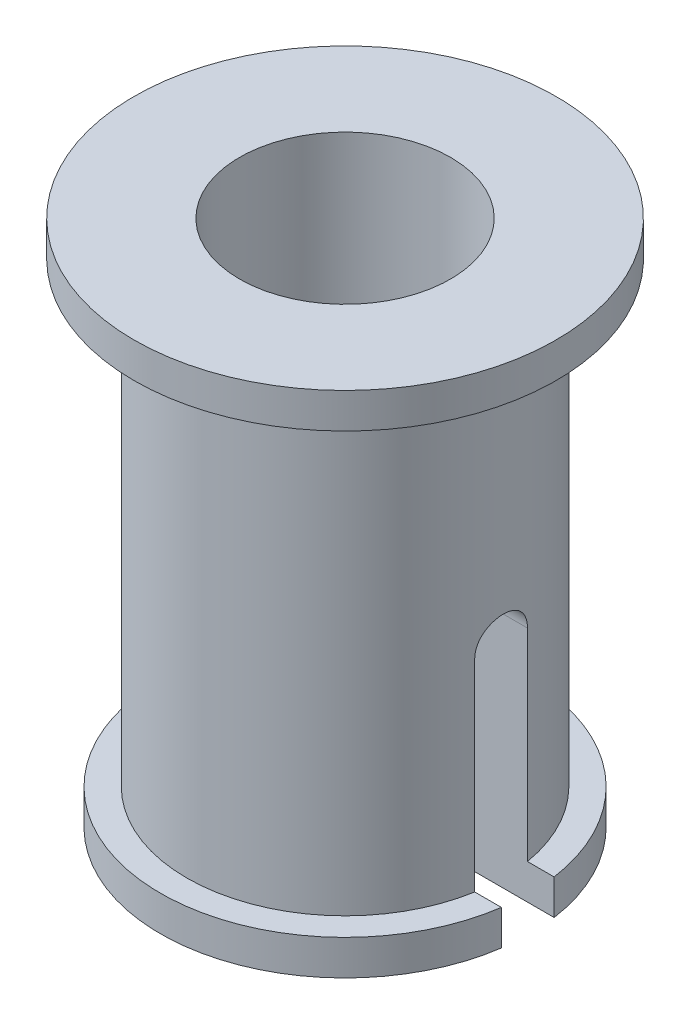
ISO-10303-21;
HEADER;
FILE_DESCRIPTION(('STEP AP214'),'2;1');
FILE_NAME('part.step','',(''),(''),'','','');
FILE_SCHEMA(('AUTOMOTIVE_DESIGN { 1 0 10303 214 1 1 1 1 }'));
ENDSEC;
DATA;
#1=APPLICATION_CONTEXT('core data for automotive mechanical design processes');
#2=APPLICATION_PROTOCOL_DEFINITION('international standard','automotive_design',2000,#1);
#3=PRODUCT_CONTEXT('',#1,'mechanical');
#4=PRODUCT('Part','Part','',(#3));
#5=PRODUCT_RELATED_PRODUCT_CATEGORY('part','',(#4));
#6=PRODUCT_DEFINITION_FORMATION('','',#4);
#7=PRODUCT_DEFINITION_CONTEXT('part definition',#1,'design');
#8=PRODUCT_DEFINITION('design','',#6,#7);
#9=PRODUCT_DEFINITION_SHAPE('','',#8);
#10=(LENGTH_UNIT() NAMED_UNIT(*) SI_UNIT(.MILLI.,.METRE.));
#11=(NAMED_UNIT(*) PLANE_ANGLE_UNIT() SI_UNIT($,.RADIAN.));
#12=(NAMED_UNIT(*) SI_UNIT($,.STERADIAN.) SOLID_ANGLE_UNIT());
#13=UNCERTAINTY_MEASURE_WITH_UNIT(LENGTH_MEASURE(1.E-05),#10,'distance_accuracy_value','');
#14=(GEOMETRIC_REPRESENTATION_CONTEXT(3) GLOBAL_UNCERTAINTY_ASSIGNED_CONTEXT((#13)) GLOBAL_UNIT_ASSIGNED_CONTEXT((#10,
#11,#12)) REPRESENTATION_CONTEXT('',''));
#15=CARTESIAN_POINT('',(0.,0.,0.));
#16=DIRECTION('',(0.,0.,1.));
#17=DIRECTION('',(1.,0.,0.));
#18=AXIS2_PLACEMENT_3D('',#15,#16,#17);
#19=CARTESIAN_POINT('',(0.,5.,0.));
#20=DIRECTION('',(0.,-1.,0.));
#21=DIRECTION('',(0.,0.,-1.));
#22=AXIS2_PLACEMENT_3D('',#19,#20,#21);
#23=CYLINDRICAL_SURFACE('',#22,1.5);
#24=CARTESIAN_POINT('',(0.,4.66666666666667,0.));
#25=DIRECTION('',(0.,1.,0.));
#26=DIRECTION('',(0.,0.,1.));
#27=AXIS2_PLACEMENT_3D('',#24,#25,#26);
#28=CIRCLE('',#27,1.5);
#29=CARTESIAN_POINT('',(0.,4.66666666666667,1.5));
#30=VERTEX_POINT('',#29);
#31=EDGE_CURVE('E158',#30,#30,#28,.T.);
#32=ORIENTED_EDGE('',*,*,#31,.F.);
#33=EDGE_LOOP('',(#32));
#34=FACE_BOUND('',#33,.T.);
#35=DIRECTION('',(0.,-1.,0.));
#36=VECTOR('',#35,1.);
#37=CARTESIAN_POINT('',(1.4790199457749,5.,0.250000000000003));
#38=LINE('',#37,#36);
#39=CARTESIAN_POINT('',(1.4790199457749,2.25,0.250000000000001));
#40=VERTEX_POINT('',#39);
#41=CARTESIAN_POINT('',(1.4790199457749,0.333333333333333,0.25));
#42=VERTEX_POINT('',#41);
#43=EDGE_CURVE('E214',#40,#42,#38,.T.);
#44=ORIENTED_EDGE('',*,*,#43,.F.);
#45=CARTESIAN_POINT('',(1.4790199457749,2.25,0.250000000000001));
#46=CARTESIAN_POINT('',(1.47901221872577,2.26396095683245,0.250012402551534));
#47=CARTESIAN_POINT('',(1.47921741048472,2.27791611938485,0.248831345018213));
#48=CARTESIAN_POINT('',(1.47999587227818,2.30541016199332,0.244176500369213));
#49=CARTESIAN_POINT('',(1.48056865919225,2.31894956403438,0.240705722404357));
#50=CARTESIAN_POINT('',(1.48202499235243,2.34524892864396,0.231564174181125));
#51=CARTESIAN_POINT('',(1.48290860685375,2.35800871929328,0.225892920688047));
#52=CARTESIAN_POINT('',(1.48488428816452,2.38239648919483,0.212519368982266));
#53=CARTESIAN_POINT('',(1.48597635768617,2.39402445371803,0.204817044343013));
#54=CARTESIAN_POINT('',(1.4882583756911,2.41593080757023,0.187519228628307));
#55=CARTESIAN_POINT('',(1.48944909400201,2.42619655698689,0.177907829040405));
#56=CARTESIAN_POINT('',(1.491787383604,2.44497851689128,0.157098237376144));
#57=CARTESIAN_POINT('',(1.49293494825854,2.45349445917116,0.145899802485204));
#58=CARTESIAN_POINT('',(1.49506576447851,2.46858167581452,0.122151951774289));
#59=CARTESIAN_POINT('',(1.49604799754859,2.47514107555226,0.109594892662244));
#60=CARTESIAN_POINT('',(1.49772877775239,2.4860523548294,0.0835387910448557));
#61=CARTESIAN_POINT('',(1.49842735944605,2.49040450331528,0.0700398635312756));
#62=CARTESIAN_POINT('',(1.49945672837495,2.49673921602822,0.0426145358003457));
#63=CARTESIAN_POINT('',(1.49979084515831,2.49874324410422,0.0286932203419586));
#64=CARTESIAN_POINT('',(1.50006508076469,2.50039158366326,0.000707863169417902));
#65=CARTESIAN_POINT('',(1.50000521702303,2.50003599956928,-0.0133561722012632));
#66=CARTESIAN_POINT('',(1.49950085758421,2.49699186011671,-0.0410802628902763));
#67=CARTESIAN_POINT('',(1.49906018069639,2.49432646686981,-0.0547429408470389));
#68=CARTESIAN_POINT('',(1.49784797400948,2.48677486104158,-0.0814242809166844));
#69=CARTESIAN_POINT('',(1.49707643624335,2.48188859498202,-0.0944429275130362));
#70=CARTESIAN_POINT('',(1.49528268120945,2.4700108264475,-0.119535849696669));
#71=CARTESIAN_POINT('',(1.49425932707671,2.46300974272845,-0.13160550541869));
#72=CARTESIAN_POINT('',(1.49207569682498,2.44710838032663,-0.154406950855712));
#73=CARTESIAN_POINT('',(1.49091541471556,2.43820801853899,-0.165138681995881));
#74=CARTESIAN_POINT('',(1.48857042314863,2.41863349651485,-0.185095754958703));
#75=CARTESIAN_POINT('',(1.48738558768296,2.40793931445142,-0.194301454502454));
#76=CARTESIAN_POINT('',(1.48513828313712,2.38514456844212,-0.210793395600476));
#77=CARTESIAN_POINT('',(1.48407584899365,2.37304360493252,-0.218079089892692));
#78=CARTESIAN_POINT('',(1.48219297916677,2.34775214208037,-0.230529023100573));
#79=CARTESIAN_POINT('',(1.48137295536583,2.33455983653606,-0.235689657078122));
#80=CARTESIAN_POINT('',(1.48007591486501,2.3074944232718,-0.243706410032311));
#81=CARTESIAN_POINT('',(1.47959838545312,2.29362236653597,-0.246565974481917));
#82=CARTESIAN_POINT('',(1.47911853225327,2.26978500932565,-0.249414284585125));
#83=CARTESIAN_POINT('',(1.47901686648485,2.25989054232892,-0.250005433378814));
#84=CARTESIAN_POINT('',(1.47901994577491,2.25,-0.25));
#85=B_SPLINE_CURVE_WITH_KNOTS('',3,(#45,#46,#47,#48,#49,#50,#51,#52,#53,#54,#55,#56,#57,#58,#59,
#60,#61,#62,#63,#64,#65,#66,#67,#68,#69,#70,#71,#72,#73,#74,#75,#76,#77,#78,#79,#80,#81,#82,#83,
#84),.UNSPECIFIED.,.F.,.F.,(4,2,2,2,2,2,2,2,2,2,2,2,2,2,2,2,2,2,2,4),(0.,0.0418228026426395,
0.083590750953894,0.125367876897847,0.167145546436639,0.209287179345357,0.251435266850383,
0.293834184215328,0.336227934166392,0.378231068338879,0.420232343704392,0.461817252795841,
0.503403163297524,0.54518038008816,0.586959425258929,0.629240298269244,0.671533209659102,
0.71389757379739,0.756198385617119,0.785863044728452),.UNSPECIFIED.);
#86=CARTESIAN_POINT('',(1.4790199457749,2.25,-0.25));
#87=VERTEX_POINT('',#86);
#88=EDGE_CURVE('E146',#40,#87,#85,.T.);
#89=ORIENTED_EDGE('',*,*,#88,.T.);
#90=DIRECTION('',(0.,-1.,0.));
#91=VECTOR('',#90,1.);
#92=CARTESIAN_POINT('',(1.4790199457749,5.,-0.25));
#93=LINE('',#92,#91);
#94=CARTESIAN_POINT('',(1.4790199457749,0.333333333333333,-0.25));
#95=VERTEX_POINT('',#94);
#96=EDGE_CURVE('E225',#87,#95,#93,.T.);
#97=ORIENTED_EDGE('',*,*,#96,.T.);
#98=CARTESIAN_POINT('',(0.,0.333333333333333,0.));
#99=DIRECTION('',(0.,-1.,0.));
#100=DIRECTION('',(0.,0.,-1.));
#101=AXIS2_PLACEMENT_3D('',#98,#99,#100);
#102=CIRCLE('',#101,1.5);
#103=CARTESIAN_POINT('',(-1.4790199457749,0.333333333333333,-0.25));
#104=VERTEX_POINT('',#103);
#105=EDGE_CURVE('E155',#104,#95,#102,.T.);
#106=ORIENTED_EDGE('',*,*,#105,.F.);
#107=DIRECTION('',(0.,-1.,0.));
#108=VECTOR('',#107,1.);
#109=CARTESIAN_POINT('',(-1.4790199457749,5.,-0.25));
#110=LINE('',#109,#108);
#111=CARTESIAN_POINT('',(-1.4790199457749,2.25,-0.25));
#112=VERTEX_POINT('',#111);
#113=EDGE_CURVE('E229',#104,#112,#110,.F.);
#114=ORIENTED_EDGE('',*,*,#113,.T.);
#115=CARTESIAN_POINT('',(-1.4790199457749,2.25,-0.25));
#116=CARTESIAN_POINT('',(-1.47901221872577,2.26396095683244,-0.250012402551532));
#117=CARTESIAN_POINT('',(-1.47921741048472,2.27791611938485,-0.248831345018212));
#118=CARTESIAN_POINT('',(-1.47999587227818,2.30541016199332,-0.244176500369212));
#119=CARTESIAN_POINT('',(-1.48056865919225,2.31894956403438,-0.240705722404356));
#120=CARTESIAN_POINT('',(-1.48202499235243,2.34524892864396,-0.231564174181124));
#121=CARTESIAN_POINT('',(-1.48290860685375,2.35800871929328,-0.225892920688045));
#122=CARTESIAN_POINT('',(-1.48488428816452,2.38239648919483,-0.212519368982264));
#123=CARTESIAN_POINT('',(-1.48597635768617,2.39402445371803,-0.204817044343012));
#124=CARTESIAN_POINT('',(-1.4882583756911,2.41593080757023,-0.187519228628305));
#125=CARTESIAN_POINT('',(-1.48944909400201,2.42619655698689,-0.177907829040403));
#126=CARTESIAN_POINT('',(-1.491787383604,2.44497851689128,-0.157098237376143));
#127=CARTESIAN_POINT('',(-1.49293494825854,2.45349445917116,-0.145899802485202));
#128=CARTESIAN_POINT('',(-1.49506576447851,2.46858167581452,-0.122151951774287));
#129=CARTESIAN_POINT('',(-1.49604799754859,2.47514107555226,-0.109594892662243));
#130=CARTESIAN_POINT('',(-1.49772877775239,2.4860523548294,-0.0835387910448543));
#131=CARTESIAN_POINT('',(-1.49842735944605,2.49040450331528,-0.0700398635312742));
#132=CARTESIAN_POINT('',(-1.49945672837495,2.49673921602822,-0.0426145358003443));
#133=CARTESIAN_POINT('',(-1.49979084515831,2.49874324410422,-0.0286932203419571));
#134=CARTESIAN_POINT('',(-1.50006508076469,2.50039158366326,-0.000707863169416467));
#135=CARTESIAN_POINT('',(-1.50000521702303,2.50003599956928,0.0133561722012646));
#136=CARTESIAN_POINT('',(-1.49950085758421,2.49699186011671,0.0410802628902777));
#137=CARTESIAN_POINT('',(-1.49906018069639,2.49432646686981,0.0547429408470403));
#138=CARTESIAN_POINT('',(-1.49784797400948,2.48677486104158,0.0814242809166857));
#139=CARTESIAN_POINT('',(-1.49707643624335,2.48188859498202,0.0944429275130376));
#140=CARTESIAN_POINT('',(-1.49528268120945,2.4700108264475,0.11953584969667));
#141=CARTESIAN_POINT('',(-1.49425932707671,2.46300974272845,0.131605505418692));
#142=CARTESIAN_POINT('',(-1.49207569682498,2.44710838032663,0.154406950855713));
#143=CARTESIAN_POINT('',(-1.49091541471556,2.43820801853899,0.165138681995883));
#144=CARTESIAN_POINT('',(-1.48857042314863,2.41863349651485,0.185095754958704));
#145=CARTESIAN_POINT('',(-1.48738558768296,2.40793931445142,0.194301454502455));
#146=CARTESIAN_POINT('',(-1.48513828313712,2.38514456844212,0.210793395600477));
#147=CARTESIAN_POINT('',(-1.48407584899365,2.37304360493252,0.218079089892694));
#148=CARTESIAN_POINT('',(-1.48219297916677,2.34775214208037,0.230529023100574));
#149=CARTESIAN_POINT('',(-1.48137295536583,2.33455983653606,0.235689657078123));
#150=CARTESIAN_POINT('',(-1.48007591486501,2.3074944232718,0.243706410032312));
#151=CARTESIAN_POINT('',(-1.47959838545312,2.29362236653597,0.246565974481918));
#152=CARTESIAN_POINT('',(-1.47911853225327,2.26978500932565,0.249414284585126));
#153=CARTESIAN_POINT('',(-1.47901686648485,2.25989054232892,0.250005433378815));
#154=CARTESIAN_POINT('',(-1.47901994577491,2.25,0.250000000000002));
#155=B_SPLINE_CURVE_WITH_KNOTS('',3,(#115,#116,#117,#118,#119,#120,#121,#122,#123,#124,#125,
#126,#127,#128,#129,#130,#131,#132,#133,#134,#135,#136,#137,#138,#139,#140,#141,#142,#143,#144,
#145,#146,#147,#148,#149,#150,#151,#152,#153,#154),.UNSPECIFIED.,.F.,.F.,(4,2,2,2,2,2,2,2,2,2,2,
2,2,2,2,2,2,2,2,4),(0.,0.0418228026426391,0.083590750953894,0.125367876897847,0.167145546436639,
0.209287179345357,0.251435266850383,0.293834184215328,0.336227934166392,0.378231068338879,
0.420232343704392,0.461817252795841,0.503403163297524,0.54518038008816,0.586959425258928,
0.629240298269243,0.671533209659102,0.71389757379739,0.756198385617119,0.785863044728452),.UNSPECIFIED.);
#156=CARTESIAN_POINT('',(-1.4790199457749,2.25,0.250000000000001));
#157=VERTEX_POINT('',#156);
#158=EDGE_CURVE('E151',#112,#157,#155,.T.);
#159=ORIENTED_EDGE('',*,*,#158,.T.);
#160=DIRECTION('',(0.,-1.,0.));
#161=VECTOR('',#160,1.);
#162=CARTESIAN_POINT('',(-1.4790199457749,5.,0.250000000000003));
#163=LINE('',#162,#161);
#164=CARTESIAN_POINT('',(-1.4790199457749,0.333333333333333,0.25));
#165=VERTEX_POINT('',#164);
#166=EDGE_CURVE('E217',#165,#157,#163,.F.);
#167=ORIENTED_EDGE('',*,*,#166,.F.);
#168=EDGE_CURVE('E133',#42,#165,#102,.T.);
#169=ORIENTED_EDGE('',*,*,#168,.F.);
#170=EDGE_LOOP('',(#44,#89,#97,#106,#114,#159,#167,#169));
#171=FACE_BOUND('',#170,.T.);
#172=ADVANCED_FACE('F33',(#34,#171),#23,.T.);
#173=CARTESIAN_POINT('',(0.,0.,0.));
#174=DIRECTION('',(0.,1.,0.));
#175=DIRECTION('',(0.,0.,1.));
#176=AXIS2_PLACEMENT_3D('',#173,#174,#175);
#177=PLANE('',#176);
#178=DIRECTION('',(1.,0.,0.));
#179=VECTOR('',#178,1.);
#180=CARTESIAN_POINT('',(-2.,0.,0.25));
#181=LINE('',#180,#179);
#182=CARTESIAN_POINT('',(0.968245836551854,0.,0.25));
#183=VERTEX_POINT('',#182);
#184=CARTESIAN_POINT('',(1.73205080756888,0.,0.25));
#185=VERTEX_POINT('',#184);
#186=EDGE_CURVE('E142',#183,#185,#181,.T.);
#187=ORIENTED_EDGE('',*,*,#186,.T.);
#188=CARTESIAN_POINT('',(0.,0.,0.));
#189=DIRECTION('',(0.,-1.,0.));
#190=DIRECTION('',(0.,0.,-1.));
#191=AXIS2_PLACEMENT_3D('',#188,#189,#190);
#192=CIRCLE('',#191,1.75);
#193=CARTESIAN_POINT('',(-1.73205080756888,0.,0.25));
#194=VERTEX_POINT('',#193);
#195=EDGE_CURVE('E145',#185,#194,#192,.T.);
#196=ORIENTED_EDGE('',*,*,#195,.T.);
#197=CARTESIAN_POINT('',(-0.968245836551854,0.,0.25));
#198=VERTEX_POINT('',#197);
#199=EDGE_CURVE('E235',#194,#198,#181,.T.);
#200=ORIENTED_EDGE('',*,*,#199,.T.);
#201=CARTESIAN_POINT('',(0.,0.,0.));
#202=DIRECTION('',(0.,1.,0.));
#203=DIRECTION('',(0.,0.,1.));
#204=AXIS2_PLACEMENT_3D('',#201,#202,#203);
#205=CIRCLE('',#204,1.);
#206=EDGE_CURVE('E162',#198,#183,#205,.T.);
#207=ORIENTED_EDGE('',*,*,#206,.T.);
#208=EDGE_LOOP('',(#187,#196,#200,#207));
#209=FACE_BOUND('',#208,.T.);
#210=ADVANCED_FACE('F259',(#209),#177,.F.);
#211=CARTESIAN_POINT('',(0.,5.,0.));
#212=DIRECTION('',(0.,-1.,0.));
#213=DIRECTION('',(0.,0.,-1.));
#214=AXIS2_PLACEMENT_3D('',#211,#212,#213);
#215=CYLINDRICAL_SURFACE('',#214,1.);
#216=CARTESIAN_POINT('',(0.,5.,0.));
#217=DIRECTION('',(0.,1.,0.));
#218=DIRECTION('',(0.,0.,1.));
#219=AXIS2_PLACEMENT_3D('',#216,#217,#218);
#220=CIRCLE('',#219,1.);
#221=CARTESIAN_POINT('',(0.,5.,1.));
#222=VERTEX_POINT('',#221);
#223=EDGE_CURVE('E169',#222,#222,#220,.T.);
#224=ORIENTED_EDGE('',*,*,#223,.T.);
#225=EDGE_LOOP('',(#224));
#226=FACE_BOUND('',#225,.T.);
#227=CARTESIAN_POINT('',(0.968245836551854,2.25,0.250000000000001));
#228=CARTESIAN_POINT('',(0.968234049545617,2.26383070607813,0.250012953215812));
#229=CARTESIAN_POINT('',(0.968541877962347,2.27765275214075,0.248853161388951));
#230=CARTESIAN_POINT('',(0.969707324249105,2.30486994361927,0.244289832798707));
#231=CARTESIAN_POINT('',(0.970563824163099,2.31826589909795,0.240890858126017));
#232=CARTESIAN_POINT('',(0.9727377402555,2.344279386634,0.231950584629504));
#233=CARTESIAN_POINT('',(0.974055113119327,2.35689699171264,0.226409487125331));
#234=CARTESIAN_POINT('',(0.976998055593671,2.38102834005615,0.213353558724009));
#235=CARTESIAN_POINT('',(0.978623707814904,2.39254178618752,0.205838198568215));
#236=CARTESIAN_POINT('',(0.982040595501114,2.41438583871804,0.18887119674902));
#237=CARTESIAN_POINT('',(0.983834461354369,2.42468868623804,0.17938433831947));
#238=CARTESIAN_POINT('',(0.987362777210994,2.44357555769966,0.158818924002211));
#239=CARTESIAN_POINT('',(0.989097217680292,2.45215930689364,0.147740114172738));
#240=CARTESIAN_POINT('',(0.992340451273177,2.46747774074516,0.124114230626838));
#241=CARTESIAN_POINT('',(0.993845760516911,2.47418497140975,0.111548836630203));
#242=CARTESIAN_POINT('',(0.996430866813653,2.48538118613491,0.0854256461644529));
#243=CARTESIAN_POINT('',(0.997510747601812,2.48987060676118,0.0718680456103894));
#244=CARTESIAN_POINT('',(0.999104749704138,2.49641474752203,0.0444360275333476));
#245=CARTESIAN_POINT('',(0.999629882170623,2.4985169179257,0.030573580608359));
#246=CARTESIAN_POINT('',(1.00009359545966,2.50037584306581,0.00268319381279078));
#247=CARTESIAN_POINT('',(1.00003225000546,2.50013289259581,-0.0113447250357131));
#248=CARTESIAN_POINT('',(0.999338093392974,2.49734250903197,-0.0388381232151192));
#249=CARTESIAN_POINT('',(0.99871799668788,2.49484634583761,-0.0523091754274905));
#250=CARTESIAN_POINT('',(0.996990826596762,2.48770283021684,-0.0786346777785571));
#251=CARTESIAN_POINT('',(0.995883731664611,2.48305538261128,-0.0914891006079816));
#252=CARTESIAN_POINT('',(0.993287494403769,2.47169967982888,-0.116351821504131));
#253=CARTESIAN_POINT('',(0.991794984571589,2.46497315144064,-0.128351407400121));
#254=CARTESIAN_POINT('',(0.988589863852097,2.44966421754278,-0.151069157807944));
#255=CARTESIAN_POINT('',(0.986877219821464,2.44108153243782,-0.161787128890331));
#256=CARTESIAN_POINT('',(0.983363915069006,2.42203027197852,-0.181942347427369));
#257=CARTESIAN_POINT('',(0.981562126239374,2.41151709086156,-0.191337275764997));
#258=CARTESIAN_POINT('',(0.978115420664843,2.38904253327155,-0.208242393795092));
#259=CARTESIAN_POINT('',(0.976470546938616,2.37708076169189,-0.215752067555646));
#260=CARTESIAN_POINT('',(0.973519534135929,2.3519636005341,-0.228701177325652));
#261=CARTESIAN_POINT('',(0.972215265658711,2.338802133734,-0.234129254490506));
#262=CARTESIAN_POINT('',(0.970117647619827,2.31172076785364,-0.242675587980693));
#263=CARTESIAN_POINT('',(0.969323534507774,2.29780203620287,-0.24579729730641));
#264=CARTESIAN_POINT('',(0.968638226662377,2.27813565481264,-0.248476158786593));
#265=CARTESIAN_POINT('',(0.968491307756439,2.27252007419789,-0.249047697741106));
#266=CARTESIAN_POINT('',(0.968295156243113,2.26127055252149,-0.249809189424918));
#267=CARTESIAN_POINT('',(0.968245765589992,2.25563665600881,-0.249999759525152));
#268=CARTESIAN_POINT('',(0.968245836551973,2.25,-0.250000000000009));
#269=B_SPLINE_CURVE_WITH_KNOTS('',3,(#227,#228,#229,#230,#231,#232,#233,#234,#235,#236,#237,
#238,#239,#240,#241,#242,#243,#244,#245,#246,#247,#248,#249,#250,#251,#252,#253,#254,#255,#256,
#257,#258,#259,#260,#261,#262,#263,#264,#265,#266,#267,#268),.UNSPECIFIED.,.F.,.F.,(4,2,2,2,2,2,
2,2,2,2,2,2,2,2,2,2,2,2,2,2,4),(0.,0.0414268569974913,0.0827695712464079,0.124108400994361,
0.165458324149683,0.207622554824989,0.249793518852794,0.292552548213583,0.335303157299057,
0.377188284256308,0.419068146109594,0.460018444166185,0.500970554157592,0.542293354093937,
0.583622382878818,0.626065654304352,0.668520528420415,0.711203880860888,0.753823199296981,
0.770751702253638,0.787652749776197),.UNSPECIFIED.);
#270=CARTESIAN_POINT('',(0.968245836551853,2.25,0.250000000000001));
#271=VERTEX_POINT('',#270);
#272=CARTESIAN_POINT('',(0.968245836551854,2.25,-0.25));
#273=VERTEX_POINT('',#272);
#274=EDGE_CURVE('E11',#271,#273,#269,.T.);
#275=ORIENTED_EDGE('',*,*,#274,.F.);
#276=DIRECTION('',(0.,-1.,0.));
#277=VECTOR('',#276,1.);
#278=CARTESIAN_POINT('',(0.968245836551853,5.,0.250000000000003));
#279=LINE('',#278,#277);
#280=EDGE_CURVE('E205',#271,#183,#279,.T.);
#281=ORIENTED_EDGE('',*,*,#280,.T.);
#282=ORIENTED_EDGE('',*,*,#206,.F.);
#283=DIRECTION('',(0.,-1.,0.));
#284=VECTOR('',#283,1.);
#285=CARTESIAN_POINT('',(-0.968245836551853,5.,0.250000000000003));
#286=LINE('',#285,#284);
#287=CARTESIAN_POINT('',(-0.968245836551853,2.25,0.250000000000001));
#288=VERTEX_POINT('',#287);
#289=EDGE_CURVE('E211',#198,#288,#286,.F.);
#290=ORIENTED_EDGE('',*,*,#289,.T.);
#291=CARTESIAN_POINT('',(-0.968245836551854,2.25,-0.25));
#292=CARTESIAN_POINT('',(-0.968234049545618,2.26383070607813,-0.250012953215811));
#293=CARTESIAN_POINT('',(-0.968541877962347,2.27765275214075,-0.24885316138895));
#294=CARTESIAN_POINT('',(-0.969707324249105,2.30486994361927,-0.244289832798706));
#295=CARTESIAN_POINT('',(-0.970563824163099,2.31826589909795,-0.240890858126015));
#296=CARTESIAN_POINT('',(-0.9727377402555,2.344279386634,-0.231950584629502));
#297=CARTESIAN_POINT('',(-0.974055113119327,2.35689699171264,-0.22640948712533));
#298=CARTESIAN_POINT('',(-0.976998055593672,2.38102834005615,-0.213353558724008));
#299=CARTESIAN_POINT('',(-0.978623707814904,2.39254178618752,-0.205838198568213));
#300=CARTESIAN_POINT('',(-0.982040595501114,2.41438583871804,-0.188871196749019));
#301=CARTESIAN_POINT('',(-0.983834461354369,2.42468868623804,-0.179384338319469));
#302=CARTESIAN_POINT('',(-0.987362777210994,2.44357555769966,-0.15881892400221));
#303=CARTESIAN_POINT('',(-0.989097217680292,2.45215930689364,-0.147740114172737));
#304=CARTESIAN_POINT('',(-0.992340451273177,2.46747774074516,-0.124114230626837));
#305=CARTESIAN_POINT('',(-0.993845760516911,2.47418497140975,-0.111548836630201));
#306=CARTESIAN_POINT('',(-0.996430866813653,2.48538118613491,-0.0854256461644516));
#307=CARTESIAN_POINT('',(-0.997510747601812,2.48987060676118,-0.071868045610388));
#308=CARTESIAN_POINT('',(-0.999104749704139,2.49641474752203,-0.0444360275333462));
#309=CARTESIAN_POINT('',(-0.999629882170623,2.4985169179257,-0.0305735806083575));
#310=CARTESIAN_POINT('',(-1.00009359545966,2.50037584306581,-0.00268319381278935));
#311=CARTESIAN_POINT('',(-1.00003225000546,2.50013289259581,0.0113447250357145));
#312=CARTESIAN_POINT('',(-0.999338093392974,2.49734250903197,0.0388381232151207));
#313=CARTESIAN_POINT('',(-0.99871799668788,2.49484634583761,0.052309175427492));
#314=CARTESIAN_POINT('',(-0.996990826596762,2.48770283021684,0.0786346777785586));
#315=CARTESIAN_POINT('',(-0.995883731664611,2.48305538261128,0.091489100607983));
#316=CARTESIAN_POINT('',(-0.993287494403768,2.47169967982888,0.116351821504132));
#317=CARTESIAN_POINT('',(-0.991794984571589,2.46497315144064,0.128351407400122));
#318=CARTESIAN_POINT('',(-0.988589863852097,2.44966421754278,0.151069157807945));
#319=CARTESIAN_POINT('',(-0.986877219821464,2.44108153243782,0.161787128890333));
#320=CARTESIAN_POINT('',(-0.983363915069006,2.42203027197852,0.18194234742737));
#321=CARTESIAN_POINT('',(-0.981562126239374,2.41151709086156,0.191337275764998));
#322=CARTESIAN_POINT('',(-0.978115420664843,2.38904253327155,0.208242393795094));
#323=CARTESIAN_POINT('',(-0.976470546938616,2.37708076169189,0.215752067555647));
#324=CARTESIAN_POINT('',(-0.973519534135928,2.3519636005341,0.228701177325654));
#325=CARTESIAN_POINT('',(-0.972215265658711,2.338802133734,0.234129254490508));
#326=CARTESIAN_POINT('',(-0.970117647619827,2.31172076785364,0.242675587980694));
#327=CARTESIAN_POINT('',(-0.969323534507774,2.29780203620287,0.245797297306411));
#328=CARTESIAN_POINT('',(-0.968638226662376,2.27813565481264,0.248476158786595));
#329=CARTESIAN_POINT('',(-0.968491307756439,2.27252007419789,0.249047697741108));
#330=CARTESIAN_POINT('',(-0.968295156243113,2.26127055252149,0.24980918942492));
#331=CARTESIAN_POINT('',(-0.968245765589992,2.25563665600881,0.249999759525153));
#332=CARTESIAN_POINT('',(-0.968245836551973,2.25,0.25000000000001));
#333=B_SPLINE_CURVE_WITH_KNOTS('',3,(#291,#292,#293,#294,#295,#296,#297,#298,#299,#300,#301,
#302,#303,#304,#305,#306,#307,#308,#309,#310,#311,#312,#313,#314,#315,#316,#317,#318,#319,#320,
#321,#322,#323,#324,#325,#326,#327,#328,#329,#330,#331,#332),.UNSPECIFIED.,.F.,.F.,(4,2,2,2,2,2,
2,2,2,2,2,2,2,2,2,2,2,2,2,2,4),(0.,0.0414268569974913,0.0827695712464079,0.124108400994361,
0.165458324149683,0.207622554824989,0.249793518852794,0.292552548213582,0.335303157299057,
0.377188284256308,0.419068146109593,0.460018444166185,0.500970554157592,0.542293354093937,
0.583622382878818,0.626065654304352,0.668520528420415,0.711203880860888,0.753823199296981,
0.770751702253638,0.787652749776197),.UNSPECIFIED.);
#334=CARTESIAN_POINT('',(-0.968245836551854,2.25,-0.25));
#335=VERTEX_POINT('',#334);
#336=EDGE_CURVE('E46',#335,#288,#333,.T.);
#337=ORIENTED_EDGE('',*,*,#336,.F.);
#338=DIRECTION('',(0.,-1.,0.));
#339=VECTOR('',#338,1.);
#340=CARTESIAN_POINT('',(-0.968245836551854,5.,-0.25));
#341=LINE('',#340,#339);
#342=CARTESIAN_POINT('',(-0.968245836551854,0.,-0.25));
#343=VERTEX_POINT('',#342);
#344=EDGE_CURVE('E223',#343,#335,#341,.F.);
#345=ORIENTED_EDGE('',*,*,#344,.F.);
#346=CARTESIAN_POINT('',(0.968245836551854,0.,-0.25));
#347=VERTEX_POINT('',#346);
#348=EDGE_CURVE('E141',#347,#343,#205,.T.);
#349=ORIENTED_EDGE('',*,*,#348,.F.);
#350=DIRECTION('',(0.,-1.,0.));
#351=VECTOR('',#350,1.);
#352=CARTESIAN_POINT('',(0.968245836551854,5.,-0.25));
#353=LINE('',#352,#351);
#354=EDGE_CURVE('E221',#273,#347,#353,.T.);
#355=ORIENTED_EDGE('',*,*,#354,.F.);
#356=EDGE_LOOP('',(#275,#281,#282,#290,#337,#345,#349,#355));
#357=FACE_BOUND('',#356,.T.);
#358=ADVANCED_FACE('F183',(#226,#357),#215,.F.);
#359=CARTESIAN_POINT('',(0.,0.333333333333333,0.));
#360=DIRECTION('',(0.,-1.,0.));
#361=DIRECTION('',(0.,0.,-1.));
#362=AXIS2_PLACEMENT_3D('',#359,#360,#361);
#363=PLANE('',#362);
#364=DIRECTION('',(1.,0.,0.));
#365=VECTOR('',#364,1.);
#366=CARTESIAN_POINT('',(0.,0.333333333333333,0.25));
#367=LINE('',#366,#365);
#368=CARTESIAN_POINT('',(-1.73205080756888,0.333333333333333,0.25));
#369=VERTEX_POINT('',#368);
#370=EDGE_CURVE('E219',#369,#165,#367,.T.);
#371=ORIENTED_EDGE('',*,*,#370,.F.);
#372=CARTESIAN_POINT('',(0.,0.333333333333333,0.));
#373=DIRECTION('',(0.,-1.,0.));
#374=DIRECTION('',(0.,0.,-1.));
#375=AXIS2_PLACEMENT_3D('',#372,#373,#374);
#376=CIRCLE('',#375,1.75);
#377=CARTESIAN_POINT('',(1.73205080756888,0.333333333333333,0.25));
#378=VERTEX_POINT('',#377);
#379=EDGE_CURVE('E166',#378,#369,#376,.T.);
#380=ORIENTED_EDGE('',*,*,#379,.F.);
#381=EDGE_CURVE('E216',#42,#378,#367,.T.);
#382=ORIENTED_EDGE('',*,*,#381,.F.);
#383=ORIENTED_EDGE('',*,*,#168,.T.);
#384=EDGE_LOOP('',(#371,#380,#382,#383));
#385=FACE_BOUND('',#384,.T.);
#386=ADVANCED_FACE('F269',(#385),#363,.F.);
#387=CARTESIAN_POINT('',(0.,0.333333333333333,0.));
#388=DIRECTION('',(0.,-1.,0.));
#389=DIRECTION('',(0.,0.,-1.));
#390=AXIS2_PLACEMENT_3D('',#387,#388,#389);
#391=CYLINDRICAL_SURFACE('',#390,1.75);
#392=ORIENTED_EDGE('',*,*,#195,.F.);
#393=DIRECTION('',(0.,-1.,0.));
#394=VECTOR('',#393,1.);
#395=CARTESIAN_POINT('',(1.73205080756888,0.333333333333333,0.25));
#396=LINE('',#395,#394);
#397=EDGE_CURVE('E178',#185,#378,#396,.F.);
#398=ORIENTED_EDGE('',*,*,#397,.T.);
#399=ORIENTED_EDGE('',*,*,#379,.T.);
#400=DIRECTION('',(0.,-1.,0.));
#401=VECTOR('',#400,1.);
#402=CARTESIAN_POINT('',(-1.73205080756888,0.333333333333333,0.25));
#403=LINE('',#402,#401);
#404=EDGE_CURVE('E175',#369,#194,#403,.T.);
#405=ORIENTED_EDGE('',*,*,#404,.T.);
#406=EDGE_LOOP('',(#392,#398,#399,#405));
#407=FACE_BOUND('',#406,.T.);
#408=ADVANCED_FACE('F262',(#407),#391,.T.);
#409=CARTESIAN_POINT('',(0.,5.,0.));
#410=DIRECTION('',(0.,1.,0.));
#411=DIRECTION('',(0.,0.,1.));
#412=AXIS2_PLACEMENT_3D('',#409,#410,#411);
#413=PLANE('',#412);
#414=ORIENTED_EDGE('',*,*,#223,.F.);
#415=EDGE_LOOP('',(#414));
#416=FACE_BOUND('',#415,.T.);
#417=CARTESIAN_POINT('',(0.,5.,0.));
#418=DIRECTION('',(0.,1.,0.));
#419=DIRECTION('',(0.,0.,1.));
#420=AXIS2_PLACEMENT_3D('',#417,#418,#419);
#421=CIRCLE('',#420,2.);
#422=CARTESIAN_POINT('',(0.,5.,2.));
#423=VERTEX_POINT('',#422);
#424=EDGE_CURVE('E163',#423,#423,#421,.T.);
#425=ORIENTED_EDGE('',*,*,#424,.T.);
#426=EDGE_LOOP('',(#425));
#427=FACE_BOUND('',#426,.T.);
#428=ADVANCED_FACE('F302',(#416,#427),#413,.T.);
#429=CARTESIAN_POINT('',(-1.73205080756888,0.,-0.25));
#430=VERTEX_POINT('',#429);
#431=CARTESIAN_POINT('',(1.73205080756888,0.,-0.25));
#432=VERTEX_POINT('',#431);
#433=EDGE_CURVE('E139',#430,#432,#192,.T.);
#434=ORIENTED_EDGE('',*,*,#433,.T.);
#435=DIRECTION('',(1.,0.,0.));
#436=VECTOR('',#435,1.);
#437=CARTESIAN_POINT('',(-2.,0.,-0.25));
#438=LINE('',#437,#436);
#439=EDGE_CURVE('E53',#347,#432,#438,.T.);
#440=ORIENTED_EDGE('',*,*,#439,.F.);
#441=ORIENTED_EDGE('',*,*,#348,.T.);
#442=EDGE_CURVE('E126',#430,#343,#438,.T.);
#443=ORIENTED_EDGE('',*,*,#442,.F.);
#444=EDGE_LOOP('',(#434,#440,#441,#443));
#445=FACE_BOUND('',#444,.T.);
#446=ADVANCED_FACE('F138',(#445),#177,.F.);
#447=CARTESIAN_POINT('',(0.,4.66666666666667,0.));
#448=DIRECTION('',(0.,1.,0.));
#449=DIRECTION('',(0.,0.,1.));
#450=AXIS2_PLACEMENT_3D('',#447,#448,#449);
#451=PLANE('',#450);
#452=CARTESIAN_POINT('',(0.,4.66666666666667,0.));
#453=DIRECTION('',(0.,1.,0.));
#454=DIRECTION('',(0.,0.,1.));
#455=AXIS2_PLACEMENT_3D('',#452,#453,#454);
#456=CIRCLE('',#455,2.);
#457=CARTESIAN_POINT('',(0.,4.66666666666667,2.));
#458=VERTEX_POINT('',#457);
#459=EDGE_CURVE('E159',#458,#458,#456,.T.);
#460=ORIENTED_EDGE('',*,*,#459,.F.);
#461=EDGE_LOOP('',(#460));
#462=FACE_BOUND('',#461,.T.);
#463=ORIENTED_EDGE('',*,*,#31,.T.);
#464=EDGE_LOOP('',(#463));
#465=FACE_BOUND('',#464,.T.);
#466=ADVANCED_FACE('F292',(#462,#465),#451,.F.);
#467=CARTESIAN_POINT('',(0.,4.66666666666667,0.));
#468=DIRECTION('',(0.,1.,0.));
#469=DIRECTION('',(0.,0.,1.));
#470=AXIS2_PLACEMENT_3D('',#467,#468,#469);
#471=CYLINDRICAL_SURFACE('',#470,2.);
#472=ORIENTED_EDGE('',*,*,#459,.T.);
#473=EDGE_LOOP('',(#472));
#474=FACE_BOUND('',#473,.T.);
#475=ORIENTED_EDGE('',*,*,#424,.F.);
#476=EDGE_LOOP('',(#475));
#477=FACE_BOUND('',#476,.T.);
#478=ADVANCED_FACE('F294',(#474,#477),#471,.T.);
#479=CARTESIAN_POINT('',(-1.73205080756888,0.333333333333333,-0.25));
#480=VERTEX_POINT('',#479);
#481=CARTESIAN_POINT('',(1.73205080756888,0.333333333333333,-0.25));
#482=VERTEX_POINT('',#481);
#483=EDGE_CURVE('E149',#480,#482,#376,.T.);
#484=ORIENTED_EDGE('',*,*,#483,.F.);
#485=DIRECTION('',(1.,0.,0.));
#486=VECTOR('',#485,1.);
#487=CARTESIAN_POINT('',(0.,0.333333333333333,-0.25));
#488=LINE('',#487,#486);
#489=EDGE_CURVE('E61',#480,#104,#488,.T.);
#490=ORIENTED_EDGE('',*,*,#489,.T.);
#491=ORIENTED_EDGE('',*,*,#105,.T.);
#492=EDGE_CURVE('E228',#95,#482,#488,.T.);
#493=ORIENTED_EDGE('',*,*,#492,.T.);
#494=EDGE_LOOP('',(#484,#490,#491,#493));
#495=FACE_BOUND('',#494,.T.);
#496=ADVANCED_FACE('F275',(#495),#363,.F.);
#497=DIRECTION('',(0.,-1.,0.));
#498=VECTOR('',#497,1.);
#499=CARTESIAN_POINT('',(1.73205080756888,0.333333333333333,-0.25));
#500=LINE('',#499,#498);
#501=EDGE_CURVE('E132',#432,#482,#500,.F.);
#502=ORIENTED_EDGE('',*,*,#501,.F.);
#503=ORIENTED_EDGE('',*,*,#433,.F.);
#504=DIRECTION('',(0.,-1.,0.));
#505=VECTOR('',#504,1.);
#506=CARTESIAN_POINT('',(-1.73205080756888,0.333333333333333,-0.25));
#507=LINE('',#506,#505);
#508=EDGE_CURVE('E123',#480,#430,#507,.T.);
#509=ORIENTED_EDGE('',*,*,#508,.F.);
#510=ORIENTED_EDGE('',*,*,#483,.T.);
#511=EDGE_LOOP('',(#502,#503,#509,#510));
#512=FACE_BOUND('',#511,.T.);
#513=ADVANCED_FACE('F144',(#512),#391,.T.);
#514=CARTESIAN_POINT('',(-2.,0.,0.25));
#515=DIRECTION('',(0.,0.,-1.));
#516=DIRECTION('',(0.,1.,0.));
#517=AXIS2_PLACEMENT_3D('',#514,#515,#516);
#518=PLANE('',#517);
#519=ORIENTED_EDGE('',*,*,#199,.F.);
#520=ORIENTED_EDGE('',*,*,#404,.F.);
#521=ORIENTED_EDGE('',*,*,#370,.T.);
#522=ORIENTED_EDGE('',*,*,#166,.T.);
#523=DIRECTION('',(1.,0.,0.));
#524=VECTOR('',#523,1.);
#525=CARTESIAN_POINT('',(-2.,2.25,0.250000000000001));
#526=LINE('',#525,#524);
#527=EDGE_CURVE('E233',#157,#288,#526,.T.);
#528=ORIENTED_EDGE('',*,*,#527,.T.);
#529=ORIENTED_EDGE('',*,*,#289,.F.);
#530=EDGE_LOOP('',(#519,#520,#521,#522,#528,#529));
#531=FACE_BOUND('',#530,.T.);
#532=ADVANCED_FACE('F257',(#531),#518,.T.);
#533=CARTESIAN_POINT('',(-2.,0.,-0.25));
#534=DIRECTION('',(0.,0.,-1.));
#535=DIRECTION('',(-1.,0.,0.));
#536=AXIS2_PLACEMENT_3D('',#533,#534,#535);
#537=PLANE('',#536);
#538=ORIENTED_EDGE('',*,*,#344,.T.);
#539=DIRECTION('',(1.,0.,0.));
#540=VECTOR('',#539,1.);
#541=CARTESIAN_POINT('',(-2.,2.25,-0.25));
#542=LINE('',#541,#540);
#543=EDGE_CURVE('E240',#112,#335,#542,.T.);
#544=ORIENTED_EDGE('',*,*,#543,.F.);
#545=ORIENTED_EDGE('',*,*,#113,.F.);
#546=ORIENTED_EDGE('',*,*,#489,.F.);
#547=ORIENTED_EDGE('',*,*,#508,.T.);
#548=ORIENTED_EDGE('',*,*,#442,.T.);
#549=EDGE_LOOP('',(#538,#544,#545,#546,#547,#548));
#550=FACE_BOUND('',#549,.T.);
#551=ADVANCED_FACE('F125',(#550),#537,.F.);
#552=CARTESIAN_POINT('',(-2.,2.25,0.));
#553=DIRECTION('',(1.,0.,0.));
#554=DIRECTION('',(0.,0.,-1.));
#555=AXIS2_PLACEMENT_3D('',#552,#553,#554);
#556=CYLINDRICAL_SURFACE('',#555,0.250000000000001);
#557=ORIENTED_EDGE('',*,*,#543,.T.);
#558=ORIENTED_EDGE('',*,*,#336,.T.);
#559=ORIENTED_EDGE('',*,*,#527,.F.);
#560=ORIENTED_EDGE('',*,*,#158,.F.);
#561=EDGE_LOOP('',(#557,#558,#559,#560));
#562=FACE_BOUND('',#561,.T.);
#563=ADVANCED_FACE('F192',(#562),#556,.F.);
#564=EDGE_CURVE('E241',#271,#40,#526,.T.);
#565=ORIENTED_EDGE('',*,*,#564,.F.);
#566=ORIENTED_EDGE('',*,*,#274,.T.);
#567=EDGE_CURVE('E237',#273,#87,#542,.T.);
#568=ORIENTED_EDGE('',*,*,#567,.T.);
#569=ORIENTED_EDGE('',*,*,#88,.F.);
#570=EDGE_LOOP('',(#565,#566,#568,#569));
#571=FACE_BOUND('',#570,.T.);
#572=ADVANCED_FACE('F187',(#571),#556,.F.);
#573=ORIENTED_EDGE('',*,*,#564,.T.);
#574=ORIENTED_EDGE('',*,*,#43,.T.);
#575=ORIENTED_EDGE('',*,*,#381,.T.);
#576=ORIENTED_EDGE('',*,*,#397,.F.);
#577=ORIENTED_EDGE('',*,*,#186,.F.);
#578=ORIENTED_EDGE('',*,*,#280,.F.);
#579=EDGE_LOOP('',(#573,#574,#575,#576,#577,#578));
#580=FACE_BOUND('',#579,.T.);
#581=ADVANCED_FACE('F191',(#580),#518,.T.);
#582=ORIENTED_EDGE('',*,*,#354,.T.);
#583=ORIENTED_EDGE('',*,*,#439,.T.);
#584=ORIENTED_EDGE('',*,*,#501,.T.);
#585=ORIENTED_EDGE('',*,*,#492,.F.);
#586=ORIENTED_EDGE('',*,*,#96,.F.);
#587=ORIENTED_EDGE('',*,*,#567,.F.);
#588=EDGE_LOOP('',(#582,#583,#584,#585,#586,#587));
#589=FACE_BOUND('',#588,.T.);
#590=ADVANCED_FACE('F194',(#589),#537,.F.);
#591=CLOSED_SHELL('',(#172,#210,#358,#386,#408,#428,#446,#466,#478,#496,#513,#532,#551,#563,
#572,#581,#590));
#592=MANIFOLD_SOLID_BREP('B2',#591);
#593=ADVANCED_BREP_SHAPE_REPRESENTATION('',(#18,#592),#14);
#594=SHAPE_DEFINITION_REPRESENTATION(#9,#593);
ENDSEC;
END-ISO-10303-21;
